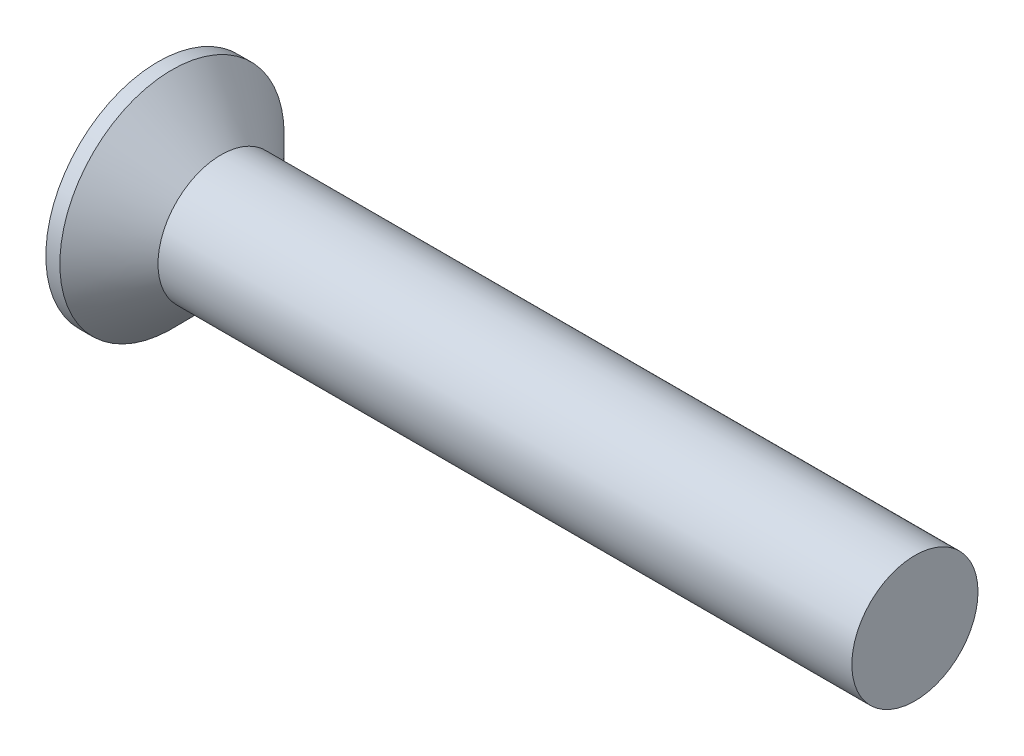
ISO-10303-21;
HEADER;
FILE_DESCRIPTION(('STEP AP214'),'2;1');
FILE_NAME('part.step','',(''),(''),'','','');
FILE_SCHEMA(('AUTOMOTIVE_DESIGN { 1 0 10303 214 1 1 1 1 }'));
ENDSEC;
DATA;
#1=APPLICATION_CONTEXT('core data for automotive mechanical design processes');
#2=APPLICATION_PROTOCOL_DEFINITION('international standard','automotive_design',2000,#1);
#3=PRODUCT_CONTEXT('',#1,'mechanical');
#4=PRODUCT('Part','Part','',(#3));
#5=PRODUCT_RELATED_PRODUCT_CATEGORY('part','',(#4));
#6=PRODUCT_DEFINITION_FORMATION('','',#4);
#7=PRODUCT_DEFINITION_CONTEXT('part definition',#1,'design');
#8=PRODUCT_DEFINITION('design','',#6,#7);
#9=PRODUCT_DEFINITION_SHAPE('','',#8);
#10=(LENGTH_UNIT() NAMED_UNIT(*) SI_UNIT(.MILLI.,.METRE.));
#11=(NAMED_UNIT(*) PLANE_ANGLE_UNIT() SI_UNIT($,.RADIAN.));
#12=(NAMED_UNIT(*) SI_UNIT($,.STERADIAN.) SOLID_ANGLE_UNIT());
#13=UNCERTAINTY_MEASURE_WITH_UNIT(LENGTH_MEASURE(1.E-05),#10,'distance_accuracy_value','');
#14=(GEOMETRIC_REPRESENTATION_CONTEXT(3) GLOBAL_UNCERTAINTY_ASSIGNED_CONTEXT((#13)) GLOBAL_UNIT_ASSIGNED_CONTEXT((#10,
#11,#12)) REPRESENTATION_CONTEXT('',''));
#15=CARTESIAN_POINT('',(0.,0.,0.));
#16=DIRECTION('',(0.,0.,1.));
#17=DIRECTION('',(1.,0.,0.));
#18=AXIS2_PLACEMENT_3D('',#15,#16,#17);
#19=CARTESIAN_POINT('',(0.,8.89,0.));
#20=DIRECTION('',(-1.,0.,0.));
#21=DIRECTION('',(0.,0.,1.));
#22=AXIS2_PLACEMENT_3D('',#19,#20,#21);
#23=PLANE('',#22);
#24=CARTESIAN_POINT('',(0.,0.,0.));
#25=DIRECTION('',(1.,0.,0.));
#26=DIRECTION('',(0.,0.,-1.));
#27=AXIS2_PLACEMENT_3D('',#24,#25,#26);
#28=CIRCLE('',#27,8.89);
#29=CARTESIAN_POINT('',(0.,0.,-8.89));
#30=VERTEX_POINT('',#29);
#31=EDGE_CURVE('E390',#30,#30,#28,.T.);
#32=ORIENTED_EDGE('',*,*,#31,.F.);
#33=EDGE_LOOP('',(#32));
#34=FACE_BOUND('',#33,.T.);
#35=DIRECTION('',(0.,0.,1.));
#36=VECTOR('',#35,1.);
#37=CARTESIAN_POINT('',(0.,1.,-1.));
#38=LINE('',#37,#36);
#39=CARTESIAN_POINT('',(0.,1.,-5.));
#40=VERTEX_POINT('',#39);
#41=CARTESIAN_POINT('',(0.,1.,-2.07164272280305));
#42=VERTEX_POINT('',#41);
#43=EDGE_CURVE('E249',#40,#42,#38,.T.);
#44=ORIENTED_EDGE('',*,*,#43,.T.);
#45=DIRECTION('',(0.,0.866025403784439,-0.499999999999999));
#46=VECTOR('',#45,1.);
#47=CARTESIAN_POINT('',(0.,0.,-1.49429245361343));
#48=LINE('',#47,#46);
#49=CARTESIAN_POINT('',(0.,3.53553390593274,-3.53553390593274));
#50=VERTEX_POINT('',#49);
#51=EDGE_CURVE('E228',#42,#50,#48,.T.);
#52=ORIENTED_EDGE('',*,*,#51,.T.);
#53=DIRECTION('',(0.,-0.499999999999999,0.866025403784439));
#54=VECTOR('',#53,1.);
#55=CARTESIAN_POINT('',(0.,1.49429245361343,0.));
#56=LINE('',#55,#54);
#57=CARTESIAN_POINT('',(0.,2.07164272280305,-1.));
#58=VERTEX_POINT('',#57);
#59=EDGE_CURVE('E238',#50,#58,#56,.T.);
#60=ORIENTED_EDGE('',*,*,#59,.T.);
#61=DIRECTION('',(0.,1.,0.));
#62=VECTOR('',#61,1.);
#63=CARTESIAN_POINT('',(0.,1.,-1.));
#64=LINE('',#63,#62);
#65=CARTESIAN_POINT('',(0.,5.,-1.));
#66=VERTEX_POINT('',#65);
#67=EDGE_CURVE('E373',#58,#66,#64,.T.);
#68=ORIENTED_EDGE('',*,*,#67,.T.);
#69=DIRECTION('',(0.,0.,1.));
#70=VECTOR('',#69,1.);
#71=CARTESIAN_POINT('',(0.,5.,-1.));
#72=LINE('',#71,#70);
#73=CARTESIAN_POINT('',(0.,5.,1.));
#74=VERTEX_POINT('',#73);
#75=EDGE_CURVE('E375',#66,#74,#72,.T.);
#76=ORIENTED_EDGE('',*,*,#75,.T.);
#77=DIRECTION('',(0.,-1.,0.));
#78=VECTOR('',#77,1.);
#79=CARTESIAN_POINT('',(0.,1.,1.));
#80=LINE('',#79,#78);
#81=CARTESIAN_POINT('',(0.,2.07164272280305,1.));
#82=VERTEX_POINT('',#81);
#83=EDGE_CURVE('E330',#74,#82,#80,.T.);
#84=ORIENTED_EDGE('',*,*,#83,.T.);
#85=DIRECTION('',(0.,0.5,0.866025403784439));
#86=VECTOR('',#85,1.);
#87=CARTESIAN_POINT('',(0.,1.49429245361343,0.));
#88=LINE('',#87,#86);
#89=CARTESIAN_POINT('',(0.,3.53553390593274,3.53553390593274));
#90=VERTEX_POINT('',#89);
#91=EDGE_CURVE('E244',#82,#90,#88,.T.);
#92=ORIENTED_EDGE('',*,*,#91,.T.);
#93=DIRECTION('',(0.,-0.866025403784439,-0.499999999999999));
#94=VECTOR('',#93,1.);
#95=CARTESIAN_POINT('',(0.,0.,1.49429245361343));
#96=LINE('',#95,#94);
#97=CARTESIAN_POINT('',(0.,1.,2.07164272280305));
#98=VERTEX_POINT('',#97);
#99=EDGE_CURVE('E257',#90,#98,#96,.T.);
#100=ORIENTED_EDGE('',*,*,#99,.T.);
#101=DIRECTION('',(0.,0.,1.));
#102=VECTOR('',#101,1.);
#103=CARTESIAN_POINT('',(0.,1.,1.));
#104=LINE('',#103,#102);
#105=CARTESIAN_POINT('',(0.,0.999999999999999,5.));
#106=VERTEX_POINT('',#105);
#107=EDGE_CURVE('E326',#98,#106,#104,.T.);
#108=ORIENTED_EDGE('',*,*,#107,.T.);
#109=DIRECTION('',(0.,-1.,0.));
#110=VECTOR('',#109,1.);
#111=CARTESIAN_POINT('',(0.,0.999999999999999,5.));
#112=LINE('',#111,#110);
#113=CARTESIAN_POINT('',(0.,-1.,5.));
#114=VERTEX_POINT('',#113);
#115=EDGE_CURVE('E354',#106,#114,#112,.T.);
#116=ORIENTED_EDGE('',*,*,#115,.T.);
#117=DIRECTION('',(0.,0.,-1.));
#118=VECTOR('',#117,1.);
#119=CARTESIAN_POINT('',(0.,-1.,0.999999999999999));
#120=LINE('',#119,#118);
#121=CARTESIAN_POINT('',(0.,-1.,2.07164272280305));
#122=VERTEX_POINT('',#121);
#123=EDGE_CURVE('E357',#114,#122,#120,.T.);
#124=ORIENTED_EDGE('',*,*,#123,.T.);
#125=DIRECTION('',(0.,-0.866025403784439,0.499999999999999));
#126=VECTOR('',#125,1.);
#127=CARTESIAN_POINT('',(0.,0.,1.49429245361343));
#128=LINE('',#127,#126);
#129=CARTESIAN_POINT('',(0.,-3.53553390593274,3.53553390593274));
#130=VERTEX_POINT('',#129);
#131=EDGE_CURVE('E260',#122,#130,#128,.T.);
#132=ORIENTED_EDGE('',*,*,#131,.T.);
#133=DIRECTION('',(0.,0.5,-0.866025403784439));
#134=VECTOR('',#133,1.);
#135=CARTESIAN_POINT('',(0.,-1.49429245361343,0.));
#136=LINE('',#135,#134);
#137=CARTESIAN_POINT('',(0.,-2.07164272280305,0.999999999999999));
#138=VERTEX_POINT('',#137);
#139=EDGE_CURVE('E263',#130,#138,#136,.T.);
#140=ORIENTED_EDGE('',*,*,#139,.T.);
#141=DIRECTION('',(0.,-1.,0.));
#142=VECTOR('',#141,1.);
#143=CARTESIAN_POINT('',(0.,-1.,0.999999999999999));
#144=LINE('',#143,#142);
#145=CARTESIAN_POINT('',(0.,-5.,0.999999999999998));
#146=VERTEX_POINT('',#145);
#147=EDGE_CURVE('E360',#138,#146,#144,.T.);
#148=ORIENTED_EDGE('',*,*,#147,.T.);
#149=DIRECTION('',(0.,0.,-1.));
#150=VECTOR('',#149,1.);
#151=CARTESIAN_POINT('',(0.,-5.,-1.));
#152=LINE('',#151,#150);
#153=CARTESIAN_POINT('',(0.,-5.,-1.));
#154=VERTEX_POINT('',#153);
#155=EDGE_CURVE('E362',#146,#154,#152,.T.);
#156=ORIENTED_EDGE('',*,*,#155,.T.);
#157=DIRECTION('',(0.,1.,0.));
#158=VECTOR('',#157,1.);
#159=CARTESIAN_POINT('',(0.,-1.,-1.));
#160=LINE('',#159,#158);
#161=CARTESIAN_POINT('',(0.,-2.07164272280305,-1.));
#162=VERTEX_POINT('',#161);
#163=EDGE_CURVE('E365',#154,#162,#160,.T.);
#164=ORIENTED_EDGE('',*,*,#163,.T.);
#165=DIRECTION('',(0.,-0.499999999999999,-0.866025403784439));
#166=VECTOR('',#165,1.);
#167=CARTESIAN_POINT('',(0.,-1.49429245361343,0.));
#168=LINE('',#167,#166);
#169=CARTESIAN_POINT('',(0.,-3.53553390593274,-3.53553390593274));
#170=VERTEX_POINT('',#169);
#171=EDGE_CURVE('E266',#162,#170,#168,.T.);
#172=ORIENTED_EDGE('',*,*,#171,.T.);
#173=DIRECTION('',(0.,0.866025403784439,0.499999999999999));
#174=VECTOR('',#173,1.);
#175=CARTESIAN_POINT('',(0.,0.,-1.49429245361343));
#176=LINE('',#175,#174);
#177=CARTESIAN_POINT('',(0.,-1.,-2.07164272280305));
#178=VERTEX_POINT('',#177);
#179=EDGE_CURVE('E250',#170,#178,#176,.T.);
#180=ORIENTED_EDGE('',*,*,#179,.T.);
#181=DIRECTION('',(0.,0.,-1.));
#182=VECTOR('',#181,1.);
#183=CARTESIAN_POINT('',(0.,-1.,-1.));
#184=LINE('',#183,#182);
#185=CARTESIAN_POINT('',(0.,-1.,-5.));
#186=VERTEX_POINT('',#185);
#187=EDGE_CURVE('E368',#178,#186,#184,.T.);
#188=ORIENTED_EDGE('',*,*,#187,.T.);
#189=DIRECTION('',(0.,1.,0.));
#190=VECTOR('',#189,1.);
#191=CARTESIAN_POINT('',(0.,1.,-5.));
#192=LINE('',#191,#190);
#193=EDGE_CURVE('E370',#186,#40,#192,.T.);
#194=ORIENTED_EDGE('',*,*,#193,.T.);
#195=EDGE_LOOP('',(#44,#52,#60,#68,#76,#84,#92,#100,#108,#116,#124,#132,#140,#148,#156,#164,
#172,#180,#188,#194));
#196=FACE_BOUND('',#195,.T.);
#197=ADVANCED_FACE('F36',(#34,#196),#23,.T.);
#198=CARTESIAN_POINT('',(2.5,1.,1.));
#199=DIRECTION('',(0.,-1.,0.));
#200=DIRECTION('',(0.,0.,-1.));
#201=AXIS2_PLACEMENT_3D('',#198,#199,#200);
#202=PLANE('',#201);
#203=ORIENTED_EDGE('',*,*,#107,.F.);
#204=DIRECTION('',(-0.921891033043757,0.,0.387449252410576));
#205=VECTOR('',#204,1.);
#206=CARTESIAN_POINT('',(2.50748346055527,1.,1.01780603560109));
#207=LINE('',#206,#205);
#208=CARTESIAN_POINT('',(1.83603530640387,1.,1.3));
#209=VERTEX_POINT('',#208);
#210=EDGE_CURVE('E301',#98,#209,#207,.F.);
#211=ORIENTED_EDGE('',*,*,#210,.T.);
#212=DIRECTION('',(-1.,0.,0.));
#213=VECTOR('',#212,1.);
#214=CARTESIAN_POINT('',(2.5,1.,1.3));
#215=LINE('',#214,#213);
#216=CARTESIAN_POINT('',(2.5,1.,1.3));
#217=VERTEX_POINT('',#216);
#218=EDGE_CURVE('E428',#209,#217,#215,.F.);
#219=ORIENTED_EDGE('',*,*,#218,.T.);
#220=DIRECTION('',(0.,0.,1.));
#221=VECTOR('',#220,1.);
#222=CARTESIAN_POINT('',(2.5,1.,1.));
#223=LINE('',#222,#221);
#224=CARTESIAN_POINT('',(2.5,0.999999999999999,3.55662432702593));
#225=VERTEX_POINT('',#224);
#226=EDGE_CURVE('E327',#217,#225,#223,.T.);
#227=ORIENTED_EDGE('',*,*,#226,.T.);
#228=DIRECTION('',(-0.866025403784438,0.,0.500000000000001));
#229=VECTOR('',#228,1.);
#230=CARTESIAN_POINT('',(0.,0.999999999999999,5.));
#231=LINE('',#230,#229);
#232=EDGE_CURVE('E384',#225,#106,#231,.T.);
#233=ORIENTED_EDGE('',*,*,#232,.T.);
#234=EDGE_LOOP('',(#203,#211,#219,#227,#233));
#235=FACE_BOUND('',#234,.T.);
#236=ADVANCED_FACE('F498',(#235),#202,.T.);
#237=CARTESIAN_POINT('',(2.5,-1.,0.999999999999999));
#238=DIRECTION('',(0.,1.,0.));
#239=DIRECTION('',(0.,0.,1.));
#240=AXIS2_PLACEMENT_3D('',#237,#238,#239);
#241=PLANE('',#240);
#242=DIRECTION('',(-1.,0.,0.));
#243=VECTOR('',#242,1.);
#244=CARTESIAN_POINT('',(2.5,-1.,1.3));
#245=LINE('',#244,#243);
#246=CARTESIAN_POINT('',(2.5,-1.,1.3));
#247=VERTEX_POINT('',#246);
#248=CARTESIAN_POINT('',(1.83603530640387,-1.,1.3));
#249=VERTEX_POINT('',#248);
#250=EDGE_CURVE('E430',#247,#249,#245,.T.);
#251=ORIENTED_EDGE('',*,*,#250,.T.);
#252=DIRECTION('',(0.921891033043757,0.,-0.387449252410576));
#253=VECTOR('',#252,1.);
#254=CARTESIAN_POINT('',(2.50748346055527,-1.,1.01780603560109));
#255=LINE('',#254,#253);
#256=EDGE_CURVE('E296',#249,#122,#255,.F.);
#257=ORIENTED_EDGE('',*,*,#256,.T.);
#258=ORIENTED_EDGE('',*,*,#123,.F.);
#259=DIRECTION('',(-0.866025403784438,0.,0.500000000000001));
#260=VECTOR('',#259,1.);
#261=CARTESIAN_POINT('',(3.60705080756888,-1.,2.91746824526945));
#262=LINE('',#261,#260);
#263=CARTESIAN_POINT('',(2.5,-1.,3.55662432702593));
#264=VERTEX_POINT('',#263);
#265=EDGE_CURVE('E411',#264,#114,#262,.T.);
#266=ORIENTED_EDGE('',*,*,#265,.F.);
#267=DIRECTION('',(0.,0.,-1.));
#268=VECTOR('',#267,1.);
#269=CARTESIAN_POINT('',(2.5,-1.,0.999999999999999));
#270=LINE('',#269,#268);
#271=EDGE_CURVE('E331',#264,#247,#270,.T.);
#272=ORIENTED_EDGE('',*,*,#271,.T.);
#273=EDGE_LOOP('',(#251,#257,#258,#266,#272));
#274=FACE_BOUND('',#273,.T.);
#275=ADVANCED_FACE('F504',(#274),#241,.T.);
#276=CARTESIAN_POINT('',(2.5,-1.,0.999999999999999));
#277=DIRECTION('',(0.,0.,-1.));
#278=DIRECTION('',(0.,1.,0.));
#279=AXIS2_PLACEMENT_3D('',#276,#277,#278);
#280=PLANE('',#279);
#281=ORIENTED_EDGE('',*,*,#147,.F.);
#282=DIRECTION('',(-0.921891033043757,-0.387449252410576,0.));
#283=VECTOR('',#282,1.);
#284=CARTESIAN_POINT('',(2.50748346055527,-1.01780603560109,0.999999999999999));
#285=LINE('',#284,#283);
#286=CARTESIAN_POINT('',(1.83603530640387,-1.3,0.999999999999999));
#287=VERTEX_POINT('',#286);
#288=EDGE_CURVE('E273',#138,#287,#285,.F.);
#289=ORIENTED_EDGE('',*,*,#288,.T.);
#290=DIRECTION('',(-1.,0.,0.));
#291=VECTOR('',#290,1.);
#292=CARTESIAN_POINT('',(2.5,-1.3,0.999999999999999));
#293=LINE('',#292,#291);
#294=CARTESIAN_POINT('',(2.5,-1.3,0.999999999999999));
#295=VERTEX_POINT('',#294);
#296=EDGE_CURVE('E433',#287,#295,#293,.F.);
#297=ORIENTED_EDGE('',*,*,#296,.T.);
#298=DIRECTION('',(0.,-1.,0.));
#299=VECTOR('',#298,1.);
#300=CARTESIAN_POINT('',(2.5,-1.,0.999999999999999));
#301=LINE('',#300,#299);
#302=CARTESIAN_POINT('',(2.5,-3.55662432702593,0.999999999999999));
#303=VERTEX_POINT('',#302);
#304=EDGE_CURVE('E334',#295,#303,#301,.T.);
#305=ORIENTED_EDGE('',*,*,#304,.T.);
#306=DIRECTION('',(-0.866025403784438,-0.500000000000001,0.));
#307=VECTOR('',#306,1.);
#308=CARTESIAN_POINT('',(0.,-5.,0.999999999999998));
#309=LINE('',#308,#307);
#310=EDGE_CURVE('E407',#303,#146,#309,.T.);
#311=ORIENTED_EDGE('',*,*,#310,.T.);
#312=EDGE_LOOP('',(#281,#289,#297,#305,#311));
#313=FACE_BOUND('',#312,.T.);
#314=ADVANCED_FACE('F569',(#313),#280,.T.);
#315=CARTESIAN_POINT('',(2.5,-1.,-1.));
#316=DIRECTION('',(0.,0.,1.));
#317=DIRECTION('',(1.,0.,0.));
#318=AXIS2_PLACEMENT_3D('',#315,#316,#317);
#319=PLANE('',#318);
#320=DIRECTION('',(-1.,0.,0.));
#321=VECTOR('',#320,1.);
#322=CARTESIAN_POINT('',(2.5,-1.3,-1.));
#323=LINE('',#322,#321);
#324=CARTESIAN_POINT('',(2.5,-1.3,-1.));
#325=VERTEX_POINT('',#324);
#326=CARTESIAN_POINT('',(1.83603530640387,-1.3,-1.));
#327=VERTEX_POINT('',#326);
#328=EDGE_CURVE('E393',#325,#327,#323,.T.);
#329=ORIENTED_EDGE('',*,*,#328,.T.);
#330=DIRECTION('',(0.921891033043757,0.387449252410576,0.));
#331=VECTOR('',#330,1.);
#332=CARTESIAN_POINT('',(2.50748346055527,-1.01780603560109,-1.));
#333=LINE('',#332,#331);
#334=EDGE_CURVE('E59',#327,#162,#333,.F.);
#335=ORIENTED_EDGE('',*,*,#334,.T.);
#336=ORIENTED_EDGE('',*,*,#163,.F.);
#337=DIRECTION('',(-0.866025403784438,-0.500000000000001,0.));
#338=VECTOR('',#337,1.);
#339=CARTESIAN_POINT('',(3.60705080756888,-2.91746824526945,-1.));
#340=LINE('',#339,#338);
#341=CARTESIAN_POINT('',(2.5,-3.55662432702593,-1.));
#342=VERTEX_POINT('',#341);
#343=EDGE_CURVE('E405',#342,#154,#340,.T.);
#344=ORIENTED_EDGE('',*,*,#343,.F.);
#345=DIRECTION('',(0.,1.,0.));
#346=VECTOR('',#345,1.);
#347=CARTESIAN_POINT('',(2.5,-1.,-1.));
#348=LINE('',#347,#346);
#349=EDGE_CURVE('E337',#342,#325,#348,.T.);
#350=ORIENTED_EDGE('',*,*,#349,.T.);
#351=EDGE_LOOP('',(#329,#335,#336,#344,#350));
#352=FACE_BOUND('',#351,.T.);
#353=ADVANCED_FACE('F464',(#352),#319,.T.);
#354=CARTESIAN_POINT('',(2.5,-1.,-1.));
#355=DIRECTION('',(0.,1.,0.));
#356=DIRECTION('',(0.,0.,1.));
#357=AXIS2_PLACEMENT_3D('',#354,#355,#356);
#358=PLANE('',#357);
#359=ORIENTED_EDGE('',*,*,#187,.F.);
#360=DIRECTION('',(-0.921891033043757,0.,-0.387449252410576));
#361=VECTOR('',#360,1.);
#362=CARTESIAN_POINT('',(2.50748346055527,-1.,-1.01780603560109));
#363=LINE('',#362,#361);
#364=CARTESIAN_POINT('',(1.83603530640387,-1.,-1.3));
#365=VERTEX_POINT('',#364);
#366=EDGE_CURVE('E321',#178,#365,#363,.F.);
#367=ORIENTED_EDGE('',*,*,#366,.T.);
#368=DIRECTION('',(-1.,0.,0.));
#369=VECTOR('',#368,1.);
#370=CARTESIAN_POINT('',(2.5,-1.,-1.3));
#371=LINE('',#370,#369);
#372=CARTESIAN_POINT('',(2.5,-1.,-1.3));
#373=VERTEX_POINT('',#372);
#374=EDGE_CURVE('E418',#365,#373,#371,.F.);
#375=ORIENTED_EDGE('',*,*,#374,.T.);
#376=DIRECTION('',(0.,0.,-1.));
#377=VECTOR('',#376,1.);
#378=CARTESIAN_POINT('',(2.5,-1.,-1.));
#379=LINE('',#378,#377);
#380=CARTESIAN_POINT('',(2.5,-1.,-3.55662432702593));
#381=VERTEX_POINT('',#380);
#382=EDGE_CURVE('E340',#373,#381,#379,.T.);
#383=ORIENTED_EDGE('',*,*,#382,.T.);
#384=DIRECTION('',(-0.866025403784438,0.,-0.500000000000001));
#385=VECTOR('',#384,1.);
#386=CARTESIAN_POINT('',(0.,-1.,-5.));
#387=LINE('',#386,#385);
#388=EDGE_CURVE('E401',#381,#186,#387,.T.);
#389=ORIENTED_EDGE('',*,*,#388,.T.);
#390=EDGE_LOOP('',(#359,#367,#375,#383,#389));
#391=FACE_BOUND('',#390,.T.);
#392=ADVANCED_FACE('F478',(#391),#358,.T.);
#393=CARTESIAN_POINT('',(2.5,1.,-1.));
#394=DIRECTION('',(0.,-1.,0.));
#395=DIRECTION('',(0.,0.,-1.));
#396=AXIS2_PLACEMENT_3D('',#393,#394,#395);
#397=PLANE('',#396);
#398=DIRECTION('',(-1.,0.,0.));
#399=VECTOR('',#398,1.);
#400=CARTESIAN_POINT('',(2.5,1.,-1.3));
#401=LINE('',#400,#399);
#402=CARTESIAN_POINT('',(2.5,1.,-1.3));
#403=VERTEX_POINT('',#402);
#404=CARTESIAN_POINT('',(1.83603530640387,1.,-1.3));
#405=VERTEX_POINT('',#404);
#406=EDGE_CURVE('E420',#403,#405,#401,.T.);
#407=ORIENTED_EDGE('',*,*,#406,.T.);
#408=DIRECTION('',(0.921891033043757,0.,0.387449252410576));
#409=VECTOR('',#408,1.);
#410=CARTESIAN_POINT('',(2.50748346055527,1.,-1.01780603560109));
#411=LINE('',#410,#409);
#412=EDGE_CURVE('E314',#405,#42,#411,.F.);
#413=ORIENTED_EDGE('',*,*,#412,.T.);
#414=ORIENTED_EDGE('',*,*,#43,.F.);
#415=DIRECTION('',(-0.866025403784438,0.,-0.500000000000001));
#416=VECTOR('',#415,1.);
#417=CARTESIAN_POINT('',(3.60705080756888,1.,-2.91746824526945));
#418=LINE('',#417,#416);
#419=CARTESIAN_POINT('',(2.5,1.,-3.55662432702593));
#420=VERTEX_POINT('',#419);
#421=EDGE_CURVE('E399',#420,#40,#418,.T.);
#422=ORIENTED_EDGE('',*,*,#421,.F.);
#423=DIRECTION('',(0.,0.,1.));
#424=VECTOR('',#423,1.);
#425=CARTESIAN_POINT('',(2.5,1.,-1.));
#426=LINE('',#425,#424);
#427=EDGE_CURVE('E343',#420,#403,#426,.T.);
#428=ORIENTED_EDGE('',*,*,#427,.T.);
#429=EDGE_LOOP('',(#407,#413,#414,#422,#428));
#430=FACE_BOUND('',#429,.T.);
#431=ADVANCED_FACE('F591',(#430),#397,.T.);
#432=CARTESIAN_POINT('',(2.5,1.,-1.));
#433=DIRECTION('',(0.,0.,1.));
#434=DIRECTION('',(1.,0.,0.));
#435=AXIS2_PLACEMENT_3D('',#432,#433,#434);
#436=PLANE('',#435);
#437=ORIENTED_EDGE('',*,*,#67,.F.);
#438=DIRECTION('',(-0.921891033043757,0.387449252410576,0.));
#439=VECTOR('',#438,1.);
#440=CARTESIAN_POINT('',(2.50748346055527,1.01780603560109,-1.));
#441=LINE('',#440,#439);
#442=CARTESIAN_POINT('',(1.83603530640387,1.3,-1.));
#443=VERTEX_POINT('',#442);
#444=EDGE_CURVE('E241',#58,#443,#441,.F.);
#445=ORIENTED_EDGE('',*,*,#444,.T.);
#446=DIRECTION('',(-1.,0.,0.));
#447=VECTOR('',#446,1.);
#448=CARTESIAN_POINT('',(2.5,1.3,-1.));
#449=LINE('',#448,#447);
#450=CARTESIAN_POINT('',(2.5,1.3,-1.));
#451=VERTEX_POINT('',#450);
#452=EDGE_CURVE('E423',#443,#451,#449,.F.);
#453=ORIENTED_EDGE('',*,*,#452,.T.);
#454=DIRECTION('',(0.,1.,0.));
#455=VECTOR('',#454,1.);
#456=CARTESIAN_POINT('',(2.5,1.,-1.));
#457=LINE('',#456,#455);
#458=CARTESIAN_POINT('',(2.5,3.55662432702593,-1.));
#459=VERTEX_POINT('',#458);
#460=EDGE_CURVE('E346',#451,#459,#457,.T.);
#461=ORIENTED_EDGE('',*,*,#460,.T.);
#462=DIRECTION('',(-0.866025403784438,0.500000000000001,0.));
#463=VECTOR('',#462,1.);
#464=CARTESIAN_POINT('',(0.,5.,-1.));
#465=LINE('',#464,#463);
#466=EDGE_CURVE('E395',#459,#66,#465,.T.);
#467=ORIENTED_EDGE('',*,*,#466,.T.);
#468=EDGE_LOOP('',(#437,#445,#453,#461,#467));
#469=FACE_BOUND('',#468,.T.);
#470=ADVANCED_FACE('F585',(#469),#436,.T.);
#471=CARTESIAN_POINT('',(2.5,1.,1.));
#472=DIRECTION('',(0.,0.,-1.));
#473=DIRECTION('',(0.,1.,0.));
#474=AXIS2_PLACEMENT_3D('',#471,#472,#473);
#475=PLANE('',#474);
#476=DIRECTION('',(-1.,0.,0.));
#477=VECTOR('',#476,1.);
#478=CARTESIAN_POINT('',(2.5,1.3,1.));
#479=LINE('',#478,#477);
#480=CARTESIAN_POINT('',(2.5,1.3,1.));
#481=VERTEX_POINT('',#480);
#482=CARTESIAN_POINT('',(1.83603530640387,1.3,1.));
#483=VERTEX_POINT('',#482);
#484=EDGE_CURVE('E425',#481,#483,#479,.T.);
#485=ORIENTED_EDGE('',*,*,#484,.T.);
#486=DIRECTION('',(0.921891033043757,-0.387449252410576,0.));
#487=VECTOR('',#486,1.);
#488=CARTESIAN_POINT('',(2.50748346055527,1.01780603560109,1.));
#489=LINE('',#488,#487);
#490=EDGE_CURVE('E306',#483,#82,#489,.F.);
#491=ORIENTED_EDGE('',*,*,#490,.T.);
#492=ORIENTED_EDGE('',*,*,#83,.F.);
#493=DIRECTION('',(-0.866025403784438,0.500000000000001,0.));
#494=VECTOR('',#493,1.);
#495=CARTESIAN_POINT('',(3.60705080756888,2.91746824526945,1.));
#496=LINE('',#495,#494);
#497=CARTESIAN_POINT('',(2.5,3.55662432702593,1.));
#498=VERTEX_POINT('',#497);
#499=EDGE_CURVE('E352',#498,#74,#496,.T.);
#500=ORIENTED_EDGE('',*,*,#499,.F.);
#501=DIRECTION('',(0.,-1.,0.));
#502=VECTOR('',#501,1.);
#503=CARTESIAN_POINT('',(2.5,1.,1.));
#504=LINE('',#503,#502);
#505=EDGE_CURVE('E349',#498,#481,#504,.T.);
#506=ORIENTED_EDGE('',*,*,#505,.T.);
#507=EDGE_LOOP('',(#485,#491,#492,#500,#506));
#508=FACE_BOUND('',#507,.T.);
#509=ADVANCED_FACE('F576',(#508),#475,.T.);
#510=CARTESIAN_POINT('',(2.5,1.,1.));
#511=DIRECTION('',(1.,0.,0.));
#512=DIRECTION('',(0.,0.,-1.));
#513=AXIS2_PLACEMENT_3D('',#510,#511,#512);
#514=PLANE('',#513);
#515=ORIENTED_EDGE('',*,*,#226,.F.);
#516=CARTESIAN_POINT('',(2.5,1.3,1.3));
#517=DIRECTION('',(1.,0.,0.));
#518=DIRECTION('',(0.,0.,-1.));
#519=AXIS2_PLACEMENT_3D('',#516,#517,#518);
#520=CIRCLE('',#519,0.3);
#521=EDGE_CURVE('E439',#217,#481,#520,.T.);
#522=ORIENTED_EDGE('',*,*,#521,.T.);
#523=ORIENTED_EDGE('',*,*,#505,.F.);
#524=DIRECTION('',(0.,0.,1.));
#525=VECTOR('',#524,1.);
#526=CARTESIAN_POINT('',(2.5,3.55662432702593,-1.));
#527=LINE('',#526,#525);
#528=EDGE_CURVE('E348',#459,#498,#527,.T.);
#529=ORIENTED_EDGE('',*,*,#528,.F.);
#530=ORIENTED_EDGE('',*,*,#460,.F.);
#531=CARTESIAN_POINT('',(2.5,1.3,-1.3));
#532=DIRECTION('',(1.,0.,0.));
#533=DIRECTION('',(0.,0.,-1.));
#534=AXIS2_PLACEMENT_3D('',#531,#532,#533);
#535=CIRCLE('',#534,0.3);
#536=EDGE_CURVE('E437',#451,#403,#535,.T.);
#537=ORIENTED_EDGE('',*,*,#536,.T.);
#538=ORIENTED_EDGE('',*,*,#427,.F.);
#539=DIRECTION('',(0.,1.,0.));
#540=VECTOR('',#539,1.);
#541=CARTESIAN_POINT('',(2.5,1.,-3.55662432702593));
#542=LINE('',#541,#540);
#543=EDGE_CURVE('E342',#381,#420,#542,.T.);
#544=ORIENTED_EDGE('',*,*,#543,.F.);
#545=ORIENTED_EDGE('',*,*,#382,.F.);
#546=CARTESIAN_POINT('',(2.5,-1.3,-1.3));
#547=DIRECTION('',(1.,0.,0.));
#548=DIRECTION('',(0.,0.,-1.));
#549=AXIS2_PLACEMENT_3D('',#546,#547,#548);
#550=CIRCLE('',#549,0.3);
#551=EDGE_CURVE('E435',#373,#325,#550,.T.);
#552=ORIENTED_EDGE('',*,*,#551,.T.);
#553=ORIENTED_EDGE('',*,*,#349,.F.);
#554=DIRECTION('',(0.,0.,-1.));
#555=VECTOR('',#554,1.);
#556=CARTESIAN_POINT('',(2.5,-3.55662432702593,-1.));
#557=LINE('',#556,#555);
#558=EDGE_CURVE('E336',#303,#342,#557,.T.);
#559=ORIENTED_EDGE('',*,*,#558,.F.);
#560=ORIENTED_EDGE('',*,*,#304,.F.);
#561=CARTESIAN_POINT('',(2.5,-1.3,1.3));
#562=DIRECTION('',(1.,0.,0.));
#563=DIRECTION('',(0.,0.,-1.));
#564=AXIS2_PLACEMENT_3D('',#561,#562,#563);
#565=CIRCLE('',#564,0.3);
#566=EDGE_CURVE('E441',#295,#247,#565,.T.);
#567=ORIENTED_EDGE('',*,*,#566,.T.);
#568=ORIENTED_EDGE('',*,*,#271,.F.);
#569=DIRECTION('',(0.,-1.,0.));
#570=VECTOR('',#569,1.);
#571=CARTESIAN_POINT('',(2.5,0.999999999999999,3.55662432702593));
#572=LINE('',#571,#570);
#573=EDGE_CURVE('E329',#225,#264,#572,.T.);
#574=ORIENTED_EDGE('',*,*,#573,.F.);
#575=EDGE_LOOP('',(#515,#522,#523,#529,#530,#537,#538,#544,#545,#552,#553,#559,#560,#567,#568,#574));
#576=FACE_BOUND('',#575,.T.);
#577=DIRECTION('',(0.,0.866025403784439,0.5));
#578=VECTOR('',#577,1.);
#579=CARTESIAN_POINT('',(2.5,1.37509752181577,0.350312034421913));
#580=LINE('',#579,#578);
#581=CARTESIAN_POINT('',(2.5,0.,-0.443600889960408));
#582=VERTEX_POINT('',#581);
#583=CARTESIAN_POINT('',(2.5,-1.04957097478771,-1.04957097478771));
#584=VERTEX_POINT('',#583);
#585=EDGE_CURVE('E324',#582,#584,#580,.F.);
#586=ORIENTED_EDGE('',*,*,#585,.F.);
#587=DIRECTION('',(0.,0.866025403784439,-0.499999999999999));
#588=VECTOR('',#587,1.);
#589=CARTESIAN_POINT('',(2.5,0.124902478184232,-0.515713369362526));
#590=LINE('',#589,#588);
#591=CARTESIAN_POINT('',(2.5,1.04957097478771,-1.04957097478771));
#592=VERTEX_POINT('',#591);
#593=EDGE_CURVE('E316',#592,#582,#590,.F.);
#594=ORIENTED_EDGE('',*,*,#593,.F.);
#595=DIRECTION('',(0.,-0.5,0.866025403784439));
#596=VECTOR('',#595,1.);
#597=CARTESIAN_POINT('',(2.5,0.149687965578087,0.50907211803133));
#598=LINE('',#597,#596);
#599=CARTESIAN_POINT('',(2.5,0.443600889960408,0.));
#600=VERTEX_POINT('',#599);
#601=EDGE_CURVE('E312',#600,#592,#598,.F.);
#602=ORIENTED_EDGE('',*,*,#601,.F.);
#603=DIRECTION('',(0.,0.5,0.866025403784439));
#604=VECTOR('',#603,1.);
#605=CARTESIAN_POINT('',(2.5,1.01571336936252,0.99092788196867));
#606=LINE('',#605,#604);
#607=CARTESIAN_POINT('',(2.5,1.04957097478771,1.04957097478771));
#608=VERTEX_POINT('',#607);
#609=EDGE_CURVE('E309',#608,#600,#606,.F.);
#610=ORIENTED_EDGE('',*,*,#609,.F.);
#611=DIRECTION('',(0.,-0.866025403784439,-0.499999999999999));
#612=VECTOR('',#611,1.);
#613=CARTESIAN_POINT('',(2.5,0.99092788196867,1.01571336936252));
#614=LINE('',#613,#612);
#615=CARTESIAN_POINT('',(2.5,0.,0.443600889960408));
#616=VERTEX_POINT('',#615);
#617=EDGE_CURVE('E304',#616,#608,#614,.F.);
#618=ORIENTED_EDGE('',*,*,#617,.F.);
#619=DIRECTION('',(0.,-0.866025403784439,0.499999999999999));
#620=VECTOR('',#619,1.);
#621=CARTESIAN_POINT('',(2.5,0.509072118031331,0.149687965578087));
#622=LINE('',#621,#620);
#623=CARTESIAN_POINT('',(2.5,-1.04957097478771,1.04957097478771));
#624=VERTEX_POINT('',#623);
#625=EDGE_CURVE('E299',#624,#616,#622,.F.);
#626=ORIENTED_EDGE('',*,*,#625,.F.);
#627=DIRECTION('',(0.,0.5,-0.866025403784439));
#628=VECTOR('',#627,1.);
#629=CARTESIAN_POINT('',(2.5,-0.515713369362526,0.124902478184232));
#630=LINE('',#629,#628);
#631=CARTESIAN_POINT('',(2.5,-0.443600889960407,0.));
#632=VERTEX_POINT('',#631);
#633=EDGE_CURVE('E294',#632,#624,#630,.F.);
#634=ORIENTED_EDGE('',*,*,#633,.F.);
#635=DIRECTION('',(0.,-0.499999999999999,-0.866025403784439));
#636=VECTOR('',#635,1.);
#637=CARTESIAN_POINT('',(2.5,0.350312034421912,1.37509752181577));
#638=LINE('',#637,#636);
#639=EDGE_CURVE('E319',#584,#632,#638,.F.);
#640=ORIENTED_EDGE('',*,*,#639,.F.);
#641=EDGE_LOOP('',(#586,#594,#602,#610,#618,#626,#634,#640));
#642=FACE_BOUND('',#641,.T.);
#643=ADVANCED_FACE('F471',(#576,#642),#514,.F.);
#644=CARTESIAN_POINT('',(2.5,-1.3,-1.3));
#645=DIRECTION('',(-1.,0.,0.));
#646=DIRECTION('',(0.,0.,1.));
#647=AXIS2_PLACEMENT_3D('',#644,#645,#646);
#648=CYLINDRICAL_SURFACE('',#647,0.3);
#649=ORIENTED_EDGE('',*,*,#374,.F.);
#650=CARTESIAN_POINT('',(2.24815691932206,-1.3,-1.3));
#651=DIRECTION('',(0.342020143325669,0.469846310392954,-0.813797681349374));
#652=DIRECTION('',(-0.939692620785908,0.171010071662835,-0.296198132726025));
#653=AXIS2_PLACEMENT_3D('',#650,#651,#652);
#654=ELLIPSE('',#653,0.877141320048924,0.3);
#655=CARTESIAN_POINT('',(2.46148676396525,-1.08786796564404,-1.08786796564404));
#656=VERTEX_POINT('',#655);
#657=EDGE_CURVE('E11',#365,#656,#654,.T.);
#658=ORIENTED_EDGE('',*,*,#657,.T.);
#659=CARTESIAN_POINT('',(2.24815691932206,-1.3,-1.3));
#660=DIRECTION('',(0.342020143325669,-0.813797681349374,0.469846310392953));
#661=DIRECTION('',(-0.939692620785908,-0.296198132726025,0.171010071662835));
#662=AXIS2_PLACEMENT_3D('',#659,#660,#661);
#663=ELLIPSE('',#662,0.877141320048924,0.3);
#664=EDGE_CURVE('E44',#656,#327,#663,.T.);
#665=ORIENTED_EDGE('',*,*,#664,.T.);
#666=ORIENTED_EDGE('',*,*,#328,.F.);
#667=ORIENTED_EDGE('',*,*,#551,.F.);
#668=EDGE_LOOP('',(#649,#658,#665,#666,#667));
#669=FACE_BOUND('',#668,.T.);
#670=ADVANCED_FACE('F460',(#669),#648,.T.);
#671=CARTESIAN_POINT('',(2.5,1.3,-1.3));
#672=DIRECTION('',(-1.,0.,0.));
#673=DIRECTION('',(0.,0.,1.));
#674=AXIS2_PLACEMENT_3D('',#671,#672,#673);
#675=CYLINDRICAL_SURFACE('',#674,0.3);
#676=CARTESIAN_POINT('',(2.24815691932206,1.3,-1.3));
#677=DIRECTION('',(0.342020143325669,0.813797681349374,0.469846310392954));
#678=DIRECTION('',(-0.939692620785908,0.296198132726025,0.171010071662835));
#679=AXIS2_PLACEMENT_3D('',#676,#677,#678);
#680=ELLIPSE('',#679,0.877141320048924,0.3);
#681=CARTESIAN_POINT('',(2.46148676396525,1.08786796564404,-1.08786796564404));
#682=VERTEX_POINT('',#681);
#683=EDGE_CURVE('E455',#443,#682,#680,.T.);
#684=ORIENTED_EDGE('',*,*,#683,.T.);
#685=CARTESIAN_POINT('',(2.24815691932206,1.3,-1.3));
#686=DIRECTION('',(0.342020143325669,-0.469846310392953,-0.813797681349374));
#687=DIRECTION('',(-0.939692620785908,-0.171010071662835,-0.296198132726025));
#688=AXIS2_PLACEMENT_3D('',#685,#686,#687);
#689=ELLIPSE('',#688,0.877141320048924,0.3);
#690=EDGE_CURVE('E231',#682,#405,#689,.T.);
#691=ORIENTED_EDGE('',*,*,#690,.T.);
#692=ORIENTED_EDGE('',*,*,#406,.F.);
#693=ORIENTED_EDGE('',*,*,#536,.F.);
#694=ORIENTED_EDGE('',*,*,#452,.F.);
#695=EDGE_LOOP('',(#684,#691,#692,#693,#694));
#696=FACE_BOUND('',#695,.T.);
#697=ADVANCED_FACE('F536',(#696),#675,.T.);
#698=CARTESIAN_POINT('',(2.5,1.3,1.3));
#699=DIRECTION('',(-1.,0.,0.));
#700=DIRECTION('',(0.,0.,1.));
#701=AXIS2_PLACEMENT_3D('',#698,#699,#700);
#702=CYLINDRICAL_SURFACE('',#701,0.3);
#703=CARTESIAN_POINT('',(2.24815691932206,1.3,1.3));
#704=DIRECTION('',(0.342020143325669,-0.469846310392953,0.813797681349374));
#705=DIRECTION('',(-0.939692620785908,-0.171010071662834,0.296198132726025));
#706=AXIS2_PLACEMENT_3D('',#703,#704,#705);
#707=ELLIPSE('',#706,0.877141320048924,0.3);
#708=CARTESIAN_POINT('',(2.46148676396525,1.08786796564404,1.08786796564404));
#709=VERTEX_POINT('',#708);
#710=EDGE_CURVE('E449',#209,#709,#707,.T.);
#711=ORIENTED_EDGE('',*,*,#710,.T.);
#712=CARTESIAN_POINT('',(2.24815691932206,1.3,1.3));
#713=DIRECTION('',(0.342020143325669,0.813797681349374,-0.469846310392954));
#714=DIRECTION('',(-0.939692620785908,0.296198132726025,-0.171010071662835));
#715=AXIS2_PLACEMENT_3D('',#712,#713,#714);
#716=ELLIPSE('',#715,0.877141320048924,0.3);
#717=EDGE_CURVE('E452',#709,#483,#716,.T.);
#718=ORIENTED_EDGE('',*,*,#717,.T.);
#719=ORIENTED_EDGE('',*,*,#484,.F.);
#720=ORIENTED_EDGE('',*,*,#521,.F.);
#721=ORIENTED_EDGE('',*,*,#218,.F.);
#722=EDGE_LOOP('',(#711,#718,#719,#720,#721));
#723=FACE_BOUND('',#722,.T.);
#724=ADVANCED_FACE('F538',(#723),#702,.T.);
#725=CARTESIAN_POINT('',(2.5,-1.3,1.3));
#726=DIRECTION('',(-1.,0.,0.));
#727=DIRECTION('',(0.,0.,1.));
#728=AXIS2_PLACEMENT_3D('',#725,#726,#727);
#729=CYLINDRICAL_SURFACE('',#728,0.3);
#730=CARTESIAN_POINT('',(2.24815691932206,-1.3,1.3));
#731=DIRECTION('',(0.342020143325669,-0.813797681349374,-0.469846310392954));
#732=DIRECTION('',(-0.939692620785908,-0.296198132726025,-0.171010071662835));
#733=AXIS2_PLACEMENT_3D('',#730,#731,#732);
#734=ELLIPSE('',#733,0.877141320048924,0.3);
#735=CARTESIAN_POINT('',(2.46148676396525,-1.08786796564403,1.08786796564403));
#736=VERTEX_POINT('',#735);
#737=EDGE_CURVE('E443',#287,#736,#734,.T.);
#738=ORIENTED_EDGE('',*,*,#737,.T.);
#739=CARTESIAN_POINT('',(2.24815691932206,-1.3,1.3));
#740=DIRECTION('',(0.342020143325669,0.469846310392953,0.813797681349374));
#741=DIRECTION('',(-0.939692620785908,0.171010071662834,0.296198132726025));
#742=AXIS2_PLACEMENT_3D('',#739,#740,#741);
#743=ELLIPSE('',#742,0.877141320048924,0.3);
#744=EDGE_CURVE('E446',#736,#249,#743,.T.);
#745=ORIENTED_EDGE('',*,*,#744,.T.);
#746=ORIENTED_EDGE('',*,*,#250,.F.);
#747=ORIENTED_EDGE('',*,*,#566,.F.);
#748=ORIENTED_EDGE('',*,*,#296,.F.);
#749=EDGE_LOOP('',(#738,#745,#746,#747,#748));
#750=FACE_BOUND('',#749,.T.);
#751=ADVANCED_FACE('F38',(#750),#729,.T.);
#752=CARTESIAN_POINT('',(60.,5.00000000000001,0.));
#753=DIRECTION('',(1.,0.,0.));
#754=DIRECTION('',(0.,0.,-1.));
#755=AXIS2_PLACEMENT_3D('',#752,#753,#754);
#756=PLANE('',#755);
#757=CARTESIAN_POINT('',(60.,0.,0.));
#758=DIRECTION('',(1.,0.,0.));
#759=DIRECTION('',(0.,0.,-1.));
#760=AXIS2_PLACEMENT_3D('',#757,#758,#759);
#761=CIRCLE('',#760,5.00000000000001);
#762=CARTESIAN_POINT('',(60.,0.,-5.00000000000001));
#763=VERTEX_POINT('',#762);
#764=EDGE_CURVE('E380',#763,#763,#761,.T.);
#765=ORIENTED_EDGE('',*,*,#764,.T.);
#766=EDGE_LOOP('',(#765));
#767=FACE_BOUND('',#766,.T.);
#768=ADVANCED_FACE('F512',(#767),#756,.T.);
#769=CARTESIAN_POINT('',(4.51581291088132,0.,0.));
#770=DIRECTION('',(1.,0.,0.));
#771=DIRECTION('',(0.,0.,-1.));
#772=AXIS2_PLACEMENT_3D('',#769,#770,#771);
#773=CYLINDRICAL_SURFACE('',#772,8.89);
#774=ORIENTED_EDGE('',*,*,#31,.T.);
#775=EDGE_LOOP('',(#774));
#776=FACE_BOUND('',#775,.T.);
#777=CARTESIAN_POINT('',(1.11000000000001,0.,0.));
#778=DIRECTION('',(1.,0.,0.));
#779=DIRECTION('',(0.,0.,-1.));
#780=AXIS2_PLACEMENT_3D('',#777,#778,#779);
#781=CIRCLE('',#780,8.88999999999999);
#782=CARTESIAN_POINT('',(1.11000000000001,0.,-8.88999999999999));
#783=VERTEX_POINT('',#782);
#784=EDGE_CURVE('E387',#783,#783,#781,.T.);
#785=ORIENTED_EDGE('',*,*,#784,.F.);
#786=EDGE_LOOP('',(#785));
#787=FACE_BOUND('',#786,.T.);
#788=ADVANCED_FACE('F510',(#776,#787),#773,.T.);
#789=CARTESIAN_POINT('',(5.,0.,0.));
#790=DIRECTION('',(-1.,0.,0.));
#791=DIRECTION('',(0.,0.,1.));
#792=AXIS2_PLACEMENT_3D('',#789,#790,#791);
#793=CONICAL_SURFACE('',#792,4.99999999999999,0.78539816339745);
#794=ORIENTED_EDGE('',*,*,#784,.T.);
#795=EDGE_LOOP('',(#794));
#796=FACE_BOUND('',#795,.T.);
#797=CARTESIAN_POINT('',(5.,0.,0.));
#798=DIRECTION('',(1.,0.,0.));
#799=DIRECTION('',(0.,0.,-1.));
#800=AXIS2_PLACEMENT_3D('',#797,#798,#799);
#801=CIRCLE('',#800,4.99999999999999);
#802=CARTESIAN_POINT('',(5.,0.,-4.99999999999999));
#803=VERTEX_POINT('',#802);
#804=EDGE_CURVE('E383',#803,#803,#801,.T.);
#805=ORIENTED_EDGE('',*,*,#804,.F.);
#806=EDGE_LOOP('',(#805));
#807=FACE_BOUND('',#806,.T.);
#808=ADVANCED_FACE('F610',(#796,#807),#793,.T.);
#809=CARTESIAN_POINT('',(4.51581291088132,0.,0.));
#810=DIRECTION('',(1.,0.,0.));
#811=DIRECTION('',(0.,0.,-1.));
#812=AXIS2_PLACEMENT_3D('',#809,#810,#811);
#813=CYLINDRICAL_SURFACE('',#812,5.);
#814=ORIENTED_EDGE('',*,*,#804,.T.);
#815=EDGE_LOOP('',(#814));
#816=FACE_BOUND('',#815,.T.);
#817=ORIENTED_EDGE('',*,*,#764,.F.);
#818=EDGE_LOOP('',(#817));
#819=FACE_BOUND('',#818,.T.);
#820=ADVANCED_FACE('F526',(#816,#819),#813,.T.);
#821=CARTESIAN_POINT('',(0.,0.999999999999999,5.));
#822=DIRECTION('',(-0.500000000000001,0.,-0.866025403784438));
#823=DIRECTION('',(-0.866025403784438,0.,0.500000000000001));
#824=AXIS2_PLACEMENT_3D('',#821,#822,#823);
#825=PLANE('',#824);
#826=ORIENTED_EDGE('',*,*,#115,.F.);
#827=ORIENTED_EDGE('',*,*,#232,.F.);
#828=ORIENTED_EDGE('',*,*,#573,.T.);
#829=ORIENTED_EDGE('',*,*,#265,.T.);
#830=EDGE_LOOP('',(#826,#827,#828,#829));
#831=FACE_BOUND('',#830,.T.);
#832=ADVANCED_FACE('F522',(#831),#825,.T.);
#833=CARTESIAN_POINT('',(0.,-5.,-1.));
#834=DIRECTION('',(-0.500000000000001,0.866025403784438,0.));
#835=DIRECTION('',(-0.866025403784438,-0.500000000000001,0.));
#836=AXIS2_PLACEMENT_3D('',#833,#834,#835);
#837=PLANE('',#836);
#838=ORIENTED_EDGE('',*,*,#155,.F.);
#839=ORIENTED_EDGE('',*,*,#310,.F.);
#840=ORIENTED_EDGE('',*,*,#558,.T.);
#841=ORIENTED_EDGE('',*,*,#343,.T.);
#842=EDGE_LOOP('',(#838,#839,#840,#841));
#843=FACE_BOUND('',#842,.T.);
#844=ADVANCED_FACE('F525',(#843),#837,.T.);
#845=CARTESIAN_POINT('',(0.,1.,-5.));
#846=DIRECTION('',(-0.500000000000001,0.,0.866025403784438));
#847=DIRECTION('',(0.866025403784438,0.,0.500000000000001));
#848=AXIS2_PLACEMENT_3D('',#845,#846,#847);
#849=PLANE('',#848);
#850=ORIENTED_EDGE('',*,*,#193,.F.);
#851=ORIENTED_EDGE('',*,*,#388,.F.);
#852=ORIENTED_EDGE('',*,*,#543,.T.);
#853=ORIENTED_EDGE('',*,*,#421,.T.);
#854=EDGE_LOOP('',(#850,#851,#852,#853));
#855=FACE_BOUND('',#854,.T.);
#856=ADVANCED_FACE('F520',(#855),#849,.T.);
#857=CARTESIAN_POINT('',(0.,5.,-1.));
#858=DIRECTION('',(-0.500000000000001,-0.866025403784438,0.));
#859=DIRECTION('',(0.866025403784438,-0.500000000000001,0.));
#860=AXIS2_PLACEMENT_3D('',#857,#858,#859);
#861=PLANE('',#860);
#862=ORIENTED_EDGE('',*,*,#75,.F.);
#863=ORIENTED_EDGE('',*,*,#466,.F.);
#864=ORIENTED_EDGE('',*,*,#528,.T.);
#865=ORIENTED_EDGE('',*,*,#499,.T.);
#866=EDGE_LOOP('',(#862,#863,#864,#865));
#867=FACE_BOUND('',#866,.T.);
#868=ADVANCED_FACE('F516',(#867),#861,.T.);
#869=CARTESIAN_POINT('',(0.,-1.49429245361343,0.));
#870=DIRECTION('',(0.342020143325669,-0.813797681349374,-0.469846310392954));
#871=DIRECTION('',(0.,0.5,-0.866025403784439));
#872=AXIS2_PLACEMENT_3D('',#869,#870,#871);
#873=PLANE('',#872);
#874=ORIENTED_EDGE('',*,*,#139,.F.);
#875=DIRECTION('',(-0.579517492079033,-0.576263601303444,0.576263601303443));
#876=VECTOR('',#875,1.);
#877=CARTESIAN_POINT('',(1.86239110577189,-1.68359980503549,1.68359980503549));
#878=LINE('',#877,#876);
#879=EDGE_CURVE('E278',#736,#130,#878,.T.);
#880=ORIENTED_EDGE('',*,*,#879,.F.);
#881=ORIENTED_EDGE('',*,*,#737,.F.);
#882=ORIENTED_EDGE('',*,*,#288,.F.);
#883=EDGE_LOOP('',(#874,#880,#881,#882));
#884=FACE_BOUND('',#883,.T.);
#885=ADVANCED_FACE('F519',(#884),#873,.F.);
#886=CARTESIAN_POINT('',(0.,0.,1.49429245361343));
#887=DIRECTION('',(0.342020143325669,0.469846310392953,0.813797681349374));
#888=DIRECTION('',(0.,-0.866025403784439,0.499999999999999));
#889=AXIS2_PLACEMENT_3D('',#886,#887,#888);
#890=PLANE('',#889);
#891=ORIENTED_EDGE('',*,*,#744,.F.);
#892=ORIENTED_EDGE('',*,*,#879,.T.);
#893=ORIENTED_EDGE('',*,*,#131,.F.);
#894=ORIENTED_EDGE('',*,*,#256,.F.);
#895=EDGE_LOOP('',(#891,#892,#893,#894));
#896=FACE_BOUND('',#895,.T.);
#897=ADVANCED_FACE('F565',(#896),#890,.F.);
#898=CARTESIAN_POINT('',(0.,0.,1.49429245361343));
#899=DIRECTION('',(0.342020143325669,-0.469846310392953,0.813797681349374));
#900=DIRECTION('',(0.,-0.866025403784439,-0.499999999999999));
#901=AXIS2_PLACEMENT_3D('',#898,#899,#900);
#902=PLANE('',#901);
#903=ORIENTED_EDGE('',*,*,#99,.F.);
#904=DIRECTION('',(-0.579517492079033,0.576263601303444,0.576263601303443));
#905=VECTOR('',#904,1.);
#906=CARTESIAN_POINT('',(1.86239110577189,1.68359980503549,1.68359980503549));
#907=LINE('',#906,#905);
#908=EDGE_CURVE('E285',#709,#90,#907,.T.);
#909=ORIENTED_EDGE('',*,*,#908,.F.);
#910=ORIENTED_EDGE('',*,*,#710,.F.);
#911=ORIENTED_EDGE('',*,*,#210,.F.);
#912=EDGE_LOOP('',(#903,#909,#910,#911));
#913=FACE_BOUND('',#912,.T.);
#914=ADVANCED_FACE('F552',(#913),#902,.F.);
#915=CARTESIAN_POINT('',(0.,1.49429245361343,0.));
#916=DIRECTION('',(0.342020143325669,0.813797681349374,-0.469846310392954));
#917=DIRECTION('',(0.,0.5,0.866025403784439));
#918=AXIS2_PLACEMENT_3D('',#915,#916,#917);
#919=PLANE('',#918);
#920=ORIENTED_EDGE('',*,*,#717,.F.);
#921=ORIENTED_EDGE('',*,*,#908,.T.);
#922=ORIENTED_EDGE('',*,*,#91,.F.);
#923=ORIENTED_EDGE('',*,*,#490,.F.);
#924=EDGE_LOOP('',(#920,#921,#922,#923));
#925=FACE_BOUND('',#924,.T.);
#926=ADVANCED_FACE('F666',(#925),#919,.F.);
#927=CARTESIAN_POINT('',(0.,1.49429245361343,0.));
#928=DIRECTION('',(0.342020143325669,0.813797681349374,0.469846310392954));
#929=DIRECTION('',(0.,-0.5,0.866025403784439));
#930=AXIS2_PLACEMENT_3D('',#927,#928,#929);
#931=PLANE('',#930);
#932=ORIENTED_EDGE('',*,*,#59,.F.);
#933=DIRECTION('',(-0.579517492079033,0.576263601303444,-0.576263601303443));
#934=VECTOR('',#933,1.);
#935=CARTESIAN_POINT('',(1.86239110577189,1.68359980503549,-1.68359980503549));
#936=LINE('',#935,#934);
#937=EDGE_CURVE('E224',#682,#50,#936,.T.);
#938=ORIENTED_EDGE('',*,*,#937,.F.);
#939=ORIENTED_EDGE('',*,*,#683,.F.);
#940=ORIENTED_EDGE('',*,*,#444,.F.);
#941=EDGE_LOOP('',(#932,#938,#939,#940));
#942=FACE_BOUND('',#941,.T.);
#943=ADVANCED_FACE('F239',(#942),#931,.F.);
#944=CARTESIAN_POINT('',(0.,0.,-1.49429245361343));
#945=DIRECTION('',(0.342020143325669,-0.469846310392953,-0.813797681349374));
#946=DIRECTION('',(0.,0.866025403784439,-0.499999999999999));
#947=AXIS2_PLACEMENT_3D('',#944,#945,#946);
#948=PLANE('',#947);
#949=ORIENTED_EDGE('',*,*,#690,.F.);
#950=ORIENTED_EDGE('',*,*,#937,.T.);
#951=ORIENTED_EDGE('',*,*,#51,.F.);
#952=ORIENTED_EDGE('',*,*,#412,.F.);
#953=EDGE_LOOP('',(#949,#950,#951,#952));
#954=FACE_BOUND('',#953,.T.);
#955=ADVANCED_FACE('F226',(#954),#948,.F.);
#956=CARTESIAN_POINT('',(0.,-1.49429245361343,0.));
#957=DIRECTION('',(0.342020143325669,-0.813797681349374,0.469846310392953));
#958=DIRECTION('',(0.,-0.499999999999999,-0.866025403784439));
#959=AXIS2_PLACEMENT_3D('',#956,#957,#958);
#960=PLANE('',#959);
#961=ORIENTED_EDGE('',*,*,#664,.F.);
#962=DIRECTION('',(-0.579517492079033,-0.576263601303444,-0.576263601303444));
#963=VECTOR('',#962,1.);
#964=CARTESIAN_POINT('',(1.86239110577189,-1.68359980503549,-1.68359980503549));
#965=LINE('',#964,#963);
#966=EDGE_CURVE('E269',#656,#170,#965,.T.);
#967=ORIENTED_EDGE('',*,*,#966,.T.);
#968=ORIENTED_EDGE('',*,*,#171,.F.);
#969=ORIENTED_EDGE('',*,*,#334,.F.);
#970=EDGE_LOOP('',(#961,#967,#968,#969));
#971=FACE_BOUND('',#970,.T.);
#972=ADVANCED_FACE('F483',(#971),#960,.F.);
#973=CARTESIAN_POINT('',(0.,0.,-1.49429245361343));
#974=DIRECTION('',(0.342020143325669,0.469846310392954,-0.813797681349374));
#975=DIRECTION('',(0.,0.866025403784439,0.5));
#976=AXIS2_PLACEMENT_3D('',#973,#974,#975);
#977=PLANE('',#976);
#978=ORIENTED_EDGE('',*,*,#179,.F.);
#979=ORIENTED_EDGE('',*,*,#966,.F.);
#980=ORIENTED_EDGE('',*,*,#657,.F.);
#981=ORIENTED_EDGE('',*,*,#366,.F.);
#982=EDGE_LOOP('',(#978,#979,#980,#981));
#983=FACE_BOUND('',#982,.T.);
#984=ADVANCED_FACE('F482',(#983),#977,.F.);
#985=ORIENTED_EDGE('',*,*,#585,.T.);
#986=CARTESIAN_POINT('',(3.55549741071992,0.,0.));
#987=VERTEX_POINT('',#986);
#988=EDGE_CURVE('E51',#987,#584,#965,.T.);
#989=ORIENTED_EDGE('',*,*,#988,.F.);
#990=DIRECTION('',(-0.921891033043757,0.,-0.387449252410576));
#991=VECTOR('',#990,1.);
#992=CARTESIAN_POINT('',(0.,0.,-1.49429245361343));
#993=LINE('',#992,#991);
#994=EDGE_CURVE('E270',#987,#582,#993,.T.);
#995=ORIENTED_EDGE('',*,*,#994,.T.);
#996=EDGE_LOOP('',(#985,#989,#995));
#997=FACE_BOUND('',#996,.T.);
#998=ADVANCED_FACE('F491',(#997),#977,.F.);
#999=ORIENTED_EDGE('',*,*,#639,.T.);
#1000=DIRECTION('',(-0.921891033043757,-0.387449252410576,0.));
#1001=VECTOR('',#1000,1.);
#1002=CARTESIAN_POINT('',(0.,-1.49429245361343,0.));
#1003=LINE('',#1002,#1001);
#1004=EDGE_CURVE('E275',#987,#632,#1003,.T.);
#1005=ORIENTED_EDGE('',*,*,#1004,.F.);
#1006=ORIENTED_EDGE('',*,*,#988,.T.);
#1007=EDGE_LOOP('',(#999,#1005,#1006));
#1008=FACE_BOUND('',#1007,.T.);
#1009=ADVANCED_FACE('F486',(#1008),#960,.F.);
#1010=ORIENTED_EDGE('',*,*,#593,.T.);
#1011=ORIENTED_EDGE('',*,*,#994,.F.);
#1012=EDGE_CURVE('E234',#987,#592,#936,.T.);
#1013=ORIENTED_EDGE('',*,*,#1012,.T.);
#1014=EDGE_LOOP('',(#1010,#1011,#1013));
#1015=FACE_BOUND('',#1014,.T.);
#1016=ADVANCED_FACE('F494',(#1015),#948,.F.);
#1017=ORIENTED_EDGE('',*,*,#601,.T.);
#1018=ORIENTED_EDGE('',*,*,#1012,.F.);
#1019=DIRECTION('',(-0.921891033043757,0.387449252410576,0.));
#1020=VECTOR('',#1019,1.);
#1021=CARTESIAN_POINT('',(0.,1.49429245361343,0.));
#1022=LINE('',#1021,#1020);
#1023=EDGE_CURVE('E235',#987,#600,#1022,.T.);
#1024=ORIENTED_EDGE('',*,*,#1023,.T.);
#1025=EDGE_LOOP('',(#1017,#1018,#1024));
#1026=FACE_BOUND('',#1025,.T.);
#1027=ADVANCED_FACE('F687',(#1026),#931,.F.);
#1028=ORIENTED_EDGE('',*,*,#609,.T.);
#1029=ORIENTED_EDGE('',*,*,#1023,.F.);
#1030=EDGE_CURVE('E286',#987,#608,#907,.T.);
#1031=ORIENTED_EDGE('',*,*,#1030,.T.);
#1032=EDGE_LOOP('',(#1028,#1029,#1031));
#1033=FACE_BOUND('',#1032,.T.);
#1034=ADVANCED_FACE('F678',(#1033),#919,.F.);
#1035=ORIENTED_EDGE('',*,*,#617,.T.);
#1036=ORIENTED_EDGE('',*,*,#1030,.F.);
#1037=DIRECTION('',(-0.921891033043757,0.,0.387449252410576));
#1038=VECTOR('',#1037,1.);
#1039=CARTESIAN_POINT('',(0.,0.,1.49429245361343));
#1040=LINE('',#1039,#1038);
#1041=EDGE_CURVE('E282',#987,#616,#1040,.T.);
#1042=ORIENTED_EDGE('',*,*,#1041,.T.);
#1043=EDGE_LOOP('',(#1035,#1036,#1042));
#1044=FACE_BOUND('',#1043,.T.);
#1045=ADVANCED_FACE('F668',(#1044),#902,.F.);
#1046=ORIENTED_EDGE('',*,*,#625,.T.);
#1047=ORIENTED_EDGE('',*,*,#1041,.F.);
#1048=EDGE_CURVE('E279',#987,#624,#878,.T.);
#1049=ORIENTED_EDGE('',*,*,#1048,.T.);
#1050=EDGE_LOOP('',(#1046,#1047,#1049));
#1051=FACE_BOUND('',#1050,.T.);
#1052=ADVANCED_FACE('F658',(#1051),#890,.F.);
#1053=ORIENTED_EDGE('',*,*,#633,.T.);
#1054=ORIENTED_EDGE('',*,*,#1048,.F.);
#1055=ORIENTED_EDGE('',*,*,#1004,.T.);
#1056=EDGE_LOOP('',(#1053,#1054,#1055));
#1057=FACE_BOUND('',#1056,.T.);
#1058=ADVANCED_FACE('F648',(#1057),#873,.F.);
#1059=CLOSED_SHELL('',(#197,#236,#275,#314,#353,#392,#431,#470,#509,#643,#670,#697,#724,#751,
#768,#788,#808,#820,#832,#844,#856,#868,#885,#897,#914,#926,#943,#955,#972,#984,#998,#1009,
#1016,#1027,#1034,#1045,#1052,#1058));
#1060=MANIFOLD_SOLID_BREP('B2',#1059);
#1061=ADVANCED_BREP_SHAPE_REPRESENTATION('',(#18,#1060),#14);
#1062=SHAPE_DEFINITION_REPRESENTATION(#9,#1061);
ENDSEC;
END-ISO-10303-21;
